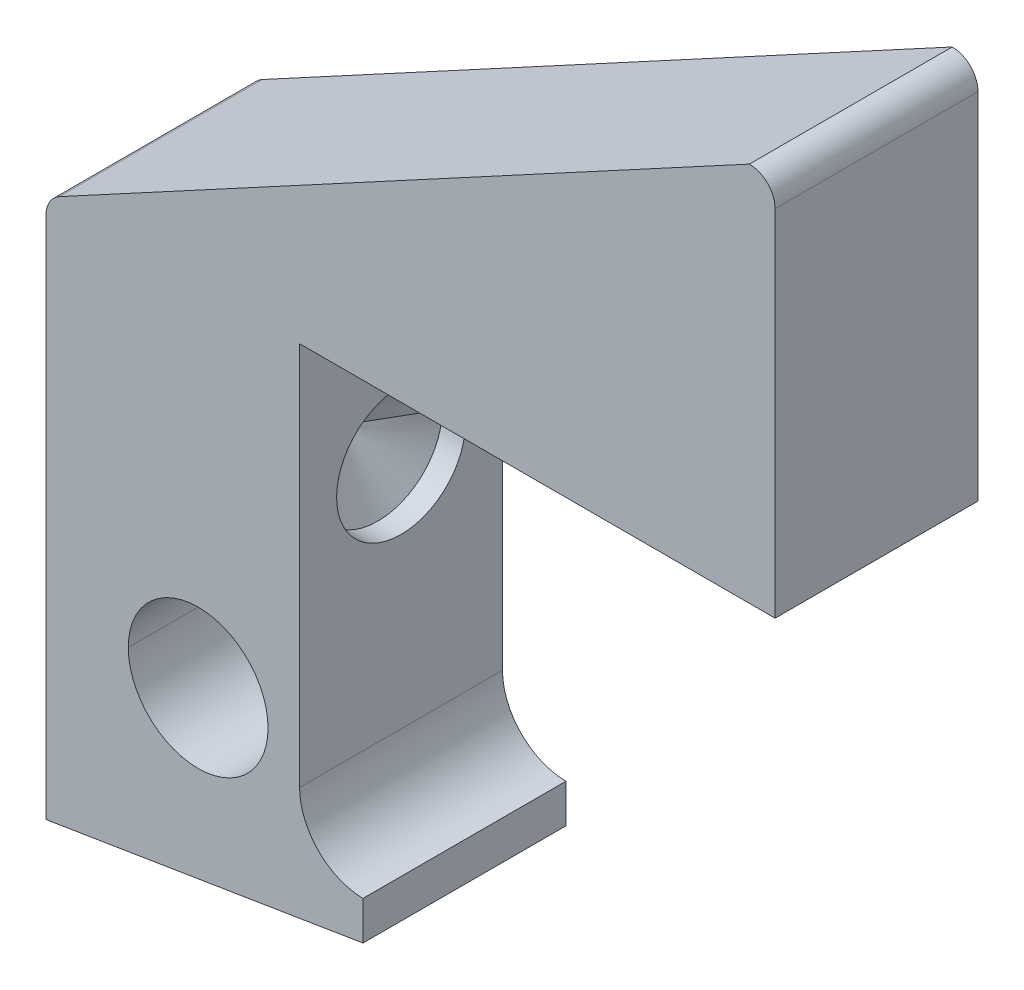
ISO-10303-21;
HEADER;
FILE_DESCRIPTION(('STEP AP214'),'2;1');
FILE_NAME('part.step','',(''),(''),'','','');
FILE_SCHEMA(('AUTOMOTIVE_DESIGN { 1 0 10303 214 1 1 1 1 }'));
ENDSEC;
DATA;
#1=APPLICATION_CONTEXT('core data for automotive mechanical design processes');
#2=APPLICATION_PROTOCOL_DEFINITION('international standard','automotive_design',2000,#1);
#3=PRODUCT_CONTEXT('',#1,'mechanical');
#4=PRODUCT('Part','Part','',(#3));
#5=PRODUCT_RELATED_PRODUCT_CATEGORY('part','',(#4));
#6=PRODUCT_DEFINITION_FORMATION('','',#4);
#7=PRODUCT_DEFINITION_CONTEXT('part definition',#1,'design');
#8=PRODUCT_DEFINITION('design','',#6,#7);
#9=PRODUCT_DEFINITION_SHAPE('','',#8);
#10=(LENGTH_UNIT() NAMED_UNIT(*) SI_UNIT(.MILLI.,.METRE.));
#11=(NAMED_UNIT(*) PLANE_ANGLE_UNIT() SI_UNIT($,.RADIAN.));
#12=(NAMED_UNIT(*) SI_UNIT($,.STERADIAN.) SOLID_ANGLE_UNIT());
#13=UNCERTAINTY_MEASURE_WITH_UNIT(LENGTH_MEASURE(1.E-05),#10,'distance_accuracy_value','');
#14=(GEOMETRIC_REPRESENTATION_CONTEXT(3) GLOBAL_UNCERTAINTY_ASSIGNED_CONTEXT((#13)) GLOBAL_UNIT_ASSIGNED_CONTEXT((#10,
#11,#12)) REPRESENTATION_CONTEXT('',''));
#15=CARTESIAN_POINT('',(0.,0.,0.));
#16=DIRECTION('',(0.,0.,1.));
#17=DIRECTION('',(1.,0.,0.));
#18=AXIS2_PLACEMENT_3D('',#15,#16,#17);
#19=CARTESIAN_POINT('',(9.99913316,12.096,4.));
#20=DIRECTION('',(-1.,0.,0.));
#21=DIRECTION('',(0.,0.,1.));
#22=AXIS2_PLACEMENT_3D('',#19,#20,#21);
#23=PLANE('',#22);
#24=CARTESIAN_POINT('',(9.99913316,21.27272472,0.));
#25=DIRECTION('',(-1.,0.,0.));
#26=DIRECTION('',(0.,0.,1.));
#27=AXIS2_PLACEMENT_3D('',#24,#25,#26);
#28=CIRCLE('',#27,2.54);
#29=CARTESIAN_POINT('',(9.99913316,21.27272472,2.54));
#30=VERTEX_POINT('',#29);
#31=CARTESIAN_POINT('',(9.99913316,21.27272472,-2.54));
#32=VERTEX_POINT('',#31);
#33=EDGE_CURVE('E11',#30,#32,#28,.T.);
#34=ORIENTED_EDGE('',*,*,#33,.T.);
#35=CARTESIAN_POINT('',(9.99913316,21.27272472,0.));
#36=DIRECTION('',(-1.,0.,0.));
#37=DIRECTION('',(0.,0.,1.));
#38=AXIS2_PLACEMENT_3D('',#35,#36,#37);
#39=CIRCLE('',#38,2.54);
#40=EDGE_CURVE('E25',#32,#30,#39,.T.);
#41=ORIENTED_EDGE('',*,*,#40,.T.);
#42=EDGE_LOOP('',(#34,#41));
#43=FACE_BOUND('',#42,.T.);
#44=DIRECTION('',(0.,1.,0.));
#45=VECTOR('',#44,1.);
#46=CARTESIAN_POINT('',(9.99913316,12.096,-4.));
#47=LINE('',#46,#45);
#48=CARTESIAN_POINT('',(9.99913316,12.096,-4.));
#49=VERTEX_POINT('',#48);
#50=CARTESIAN_POINT('',(9.99913316,27.24989158,-4.));
#51=VERTEX_POINT('',#50);
#52=EDGE_CURVE('E305',#49,#51,#47,.T.);
#53=ORIENTED_EDGE('',*,*,#52,.T.);
#54=DIRECTION('',(0.,0.,-1.));
#55=VECTOR('',#54,1.);
#56=CARTESIAN_POINT('',(9.99913316,27.24989158,4.));
#57=LINE('',#56,#55);
#58=CARTESIAN_POINT('',(9.99913316,27.24989158,4.));
#59=VERTEX_POINT('',#58);
#60=EDGE_CURVE('E300',#59,#51,#57,.T.);
#61=ORIENTED_EDGE('',*,*,#60,.F.);
#62=DIRECTION('',(0.,1.,0.));
#63=VECTOR('',#62,1.);
#64=CARTESIAN_POINT('',(9.99913316,12.096,4.));
#65=LINE('',#64,#63);
#66=CARTESIAN_POINT('',(9.99913316,12.096,4.));
#67=VERTEX_POINT('',#66);
#68=EDGE_CURVE('E295',#67,#59,#65,.T.);
#69=ORIENTED_EDGE('',*,*,#68,.F.);
#70=DIRECTION('',(0.,0.,-1.));
#71=VECTOR('',#70,1.);
#72=CARTESIAN_POINT('',(9.99913316,12.096,4.));
#73=LINE('',#72,#71);
#74=EDGE_CURVE('E291',#67,#49,#73,.T.);
#75=ORIENTED_EDGE('',*,*,#74,.T.);
#76=EDGE_LOOP('',(#53,#61,#69,#75));
#77=FACE_BOUND('',#76,.T.);
#78=ADVANCED_FACE('F17',(#43,#77),#23,.F.);
#79=CARTESIAN_POINT('',(12.5391331599986,12.0959999999986,4.));
#80=DIRECTION('',(0.,0.,1.));
#81=DIRECTION('',(0.712682713138008,0.701486529018375,0.));
#82=AXIS2_PLACEMENT_3D('',#79,#80,#81);
#83=CYLINDRICAL_SURFACE('',#82,2.54);
#84=DIRECTION('',(0.,0.,-1.));
#85=VECTOR('',#84,1.);
#86=CARTESIAN_POINT('',(12.49891658,9.5563184005287,4.));
#87=LINE('',#86,#85);
#88=CARTESIAN_POINT('',(12.49891658,9.5563184005287,4.));
#89=VERTEX_POINT('',#88);
#90=CARTESIAN_POINT('',(12.49891658,9.5563184005287,-4.));
#91=VERTEX_POINT('',#90);
#92=EDGE_CURVE('E287',#89,#91,#87,.T.);
#93=ORIENTED_EDGE('',*,*,#92,.T.);
#94=CARTESIAN_POINT('',(12.5391331599986,12.0959999999986,-4.));
#95=DIRECTION('',(0.,0.,1.));
#96=DIRECTION('',(1.,0.,0.));
#97=AXIS2_PLACEMENT_3D('',#94,#95,#96);
#98=CIRCLE('',#97,2.54);
#99=EDGE_CURVE('E282',#49,#91,#98,.T.);
#100=ORIENTED_EDGE('',*,*,#99,.F.);
#101=ORIENTED_EDGE('',*,*,#74,.F.);
#102=CARTESIAN_POINT('',(12.5391331599986,12.0959999999986,4.));
#103=DIRECTION('',(0.,0.,1.));
#104=DIRECTION('',(1.,0.,0.));
#105=AXIS2_PLACEMENT_3D('',#102,#103,#104);
#106=CIRCLE('',#105,2.54);
#107=EDGE_CURVE('E278',#67,#89,#106,.T.);
#108=ORIENTED_EDGE('',*,*,#107,.T.);
#109=EDGE_LOOP('',(#93,#100,#101,#108));
#110=FACE_BOUND('',#109,.T.);
#111=ADVANCED_FACE('F361',(#110),#83,.F.);
#112=CARTESIAN_POINT('',(12.5391331599986,12.0959999999986,4.));
#113=DIRECTION('',(0.,0.,1.));
#114=DIRECTION('',(1.,0.,0.));
#115=AXIS2_PLACEMENT_3D('',#112,#113,#114);
#116=PLANE('',#115);
#117=CARTESIAN_POINT('',(6.,13.5,4.));
#118=DIRECTION('',(0.,0.,1.));
#119=DIRECTION('',(1.,0.,0.));
#120=AXIS2_PLACEMENT_3D('',#117,#118,#119);
#121=CIRCLE('',#120,2.7559);
#122=CARTESIAN_POINT('',(8.7559,13.5,4.));
#123=VERTEX_POINT('',#122);
#124=CARTESIAN_POINT('',(3.2441,13.5,4.));
#125=VERTEX_POINT('',#124);
#126=EDGE_CURVE('E273',#123,#125,#121,.T.);
#127=ORIENTED_EDGE('',*,*,#126,.F.);
#128=CARTESIAN_POINT('',(6.,13.5,4.));
#129=DIRECTION('',(0.,0.,1.));
#130=DIRECTION('',(1.,0.,0.));
#131=AXIS2_PLACEMENT_3D('',#128,#129,#130);
#132=CIRCLE('',#131,2.7559);
#133=EDGE_CURVE('E268',#125,#123,#132,.T.);
#134=ORIENTED_EDGE('',*,*,#133,.F.);
#135=EDGE_LOOP('',(#127,#134));
#136=FACE_BOUND('',#135,.T.);
#137=DIRECTION('',(0.,-1.,0.));
#138=VECTOR('',#137,1.);
#139=CARTESIAN_POINT('',(0.,26.644315150143,4.));
#140=LINE('',#139,#138);
#141=CARTESIAN_POINT('',(0.,26.644315150143,4.));
#142=VERTEX_POINT('',#141);
#143=CARTESIAN_POINT('',(0.,6.,4.));
#144=VERTEX_POINT('',#143);
#145=EDGE_CURVE('E264',#142,#144,#140,.T.);
#146=ORIENTED_EDGE('',*,*,#145,.T.);
#147=DIRECTION('',(0.987041154037592,0.160467318280509,0.));
#148=VECTOR('',#147,1.);
#149=CARTESIAN_POINT('',(0.,6.,4.));
#150=LINE('',#149,#148);
#151=CARTESIAN_POINT('',(12.49891658,8.032,4.));
#152=VERTEX_POINT('',#151);
#153=EDGE_CURVE('E260',#144,#152,#150,.T.);
#154=ORIENTED_EDGE('',*,*,#153,.T.);
#155=DIRECTION('',(0.,1.,0.));
#156=VECTOR('',#155,1.);
#157=CARTESIAN_POINT('',(12.49891658,8.032,4.));
#158=LINE('',#157,#156);
#159=EDGE_CURVE('E255',#152,#89,#158,.T.);
#160=ORIENTED_EDGE('',*,*,#159,.T.);
#161=ORIENTED_EDGE('',*,*,#107,.F.);
#162=ORIENTED_EDGE('',*,*,#68,.T.);
#163=DIRECTION('',(1.,0.,0.));
#164=VECTOR('',#163,1.);
#165=CARTESIAN_POINT('',(9.99913316,27.24989158,4.));
#166=LINE('',#165,#164);
#167=CARTESIAN_POINT('',(28.75010842,27.24989158,4.));
#168=VERTEX_POINT('',#167);
#169=EDGE_CURVE('E251',#59,#168,#166,.T.);
#170=ORIENTED_EDGE('',*,*,#169,.T.);
#171=DIRECTION('',(0.,1.,0.));
#172=VECTOR('',#171,1.);
#173=CARTESIAN_POINT('',(28.75010842,27.24989158,4.));
#174=LINE('',#173,#172);
#175=CARTESIAN_POINT('',(28.75010842,41.23389158,4.));
#176=VERTEX_POINT('',#175);
#177=EDGE_CURVE('E247',#168,#176,#174,.T.);
#178=ORIENTED_EDGE('',*,*,#177,.T.);
#179=CARTESIAN_POINT('',(27.7341084200016,41.2338915800016,4.));
#180=DIRECTION('',(0.,0.,1.));
#181=DIRECTION('',(1.,0.,0.));
#182=AXIS2_PLACEMENT_3D('',#179,#180,#181);
#183=CIRCLE('',#182,1.016);
#184=CARTESIAN_POINT('',(27.73410842,42.24989158,4.));
#185=VERTEX_POINT('',#184);
#186=EDGE_CURVE('E243',#176,#185,#183,.T.);
#187=ORIENTED_EDGE('',*,*,#186,.T.);
#188=DIRECTION('',(-0.879592524607304,-0.475727853562254,0.));
#189=VECTOR('',#188,1.);
#190=CARTESIAN_POINT('',(27.73410842,42.24989158,4.));
#191=LINE('',#190,#189);
#192=CARTESIAN_POINT('',(0.532660500780751,27.537981155144,4.));
#193=VERTEX_POINT('',#192);
#194=EDGE_CURVE('E239',#185,#193,#191,.T.);
#195=ORIENTED_EDGE('',*,*,#194,.T.);
#196=CARTESIAN_POINT('',(1.01600000000114,26.6443151501423,4.));
#197=DIRECTION('',(0.,0.,1.));
#198=DIRECTION('',(1.,0.,0.));
#199=AXIS2_PLACEMENT_3D('',#196,#197,#198);
#200=CIRCLE('',#199,1.016);
#201=EDGE_CURVE('E235',#193,#142,#200,.T.);
#202=ORIENTED_EDGE('',*,*,#201,.T.);
#203=EDGE_LOOP('',(#146,#154,#160,#161,#162,#170,#178,#187,#195,#202));
#204=FACE_BOUND('',#203,.T.);
#205=ADVANCED_FACE('F334',(#136,#204),#116,.T.);
#206=CARTESIAN_POINT('',(1.01600000000114,26.6443151501423,4.));
#207=DIRECTION('',(0.,0.,1.));
#208=DIRECTION('',(0.858990062097008,-0.511992258943999,0.));
#209=AXIS2_PLACEMENT_3D('',#206,#207,#208);
#210=CYLINDRICAL_SURFACE('',#209,1.016);
#211=CARTESIAN_POINT('',(1.01600000000114,26.6443151501423,-4.));
#212=DIRECTION('',(0.,0.,1.));
#213=DIRECTION('',(1.,0.,0.));
#214=AXIS2_PLACEMENT_3D('',#211,#212,#213);
#215=CIRCLE('',#214,1.016);
#216=CARTESIAN_POINT('',(0.532660500780751,27.537981155144,-4.));
#217=VERTEX_POINT('',#216);
#218=CARTESIAN_POINT('',(0.,26.644315150143,-4.));
#219=VERTEX_POINT('',#218);
#220=EDGE_CURVE('E231',#217,#219,#215,.T.);
#221=ORIENTED_EDGE('',*,*,#220,.T.);
#222=DIRECTION('',(0.,0.,-1.));
#223=VECTOR('',#222,1.);
#224=CARTESIAN_POINT('',(0.,26.644315150143,4.));
#225=LINE('',#224,#223);
#226=EDGE_CURVE('E226',#142,#219,#225,.T.);
#227=ORIENTED_EDGE('',*,*,#226,.F.);
#228=ORIENTED_EDGE('',*,*,#201,.F.);
#229=DIRECTION('',(0.,0.,-1.));
#230=VECTOR('',#229,1.);
#231=CARTESIAN_POINT('',(0.532660500780751,27.537981155144,4.));
#232=LINE('',#231,#230);
#233=EDGE_CURVE('E222',#193,#217,#232,.T.);
#234=ORIENTED_EDGE('',*,*,#233,.T.);
#235=EDGE_LOOP('',(#221,#227,#228,#234));
#236=FACE_BOUND('',#235,.T.);
#237=ADVANCED_FACE('F346',(#236),#210,.T.);
#238=CARTESIAN_POINT('',(27.73410842,42.24989158,4.));
#239=DIRECTION('',(0.475727853562254,-0.879592524607304,0.));
#240=DIRECTION('',(0.879592524607304,0.475727853562254,0.));
#241=AXIS2_PLACEMENT_3D('',#238,#239,#240);
#242=PLANE('',#241);
#243=DIRECTION('',(-0.879592524607304,-0.475727853562254,0.));
#244=VECTOR('',#243,1.);
#245=CARTESIAN_POINT('',(27.73410842,42.24989158,-4.));
#246=LINE('',#245,#244);
#247=CARTESIAN_POINT('',(27.73410842,42.24989158,-4.));
#248=VERTEX_POINT('',#247);
#249=EDGE_CURVE('E217',#248,#217,#246,.T.);
#250=ORIENTED_EDGE('',*,*,#249,.T.);
#251=ORIENTED_EDGE('',*,*,#233,.F.);
#252=ORIENTED_EDGE('',*,*,#194,.F.);
#253=DIRECTION('',(0.,0.,-1.));
#254=VECTOR('',#253,1.);
#255=CARTESIAN_POINT('',(27.73410842,42.24989158,4.));
#256=LINE('',#255,#254);
#257=EDGE_CURVE('E213',#185,#248,#256,.T.);
#258=ORIENTED_EDGE('',*,*,#257,.T.);
#259=EDGE_LOOP('',(#250,#251,#252,#258));
#260=FACE_BOUND('',#259,.T.);
#261=ADVANCED_FACE('F340',(#260),#242,.F.);
#262=CARTESIAN_POINT('',(27.7341084200016,41.2338915800016,4.));
#263=DIRECTION('',(0.,0.,1.));
#264=DIRECTION('',(-0.707106781186546,-0.707106781186549,0.));
#265=AXIS2_PLACEMENT_3D('',#262,#263,#264);
#266=CYLINDRICAL_SURFACE('',#265,1.016);
#267=CARTESIAN_POINT('',(27.7341084200016,41.2338915800016,-4.));
#268=DIRECTION('',(0.,0.,1.));
#269=DIRECTION('',(1.,0.,0.));
#270=AXIS2_PLACEMENT_3D('',#267,#268,#269);
#271=CIRCLE('',#270,1.016);
#272=CARTESIAN_POINT('',(28.75010842,41.23389158,-4.));
#273=VERTEX_POINT('',#272);
#274=EDGE_CURVE('E208',#273,#248,#271,.T.);
#275=ORIENTED_EDGE('',*,*,#274,.T.);
#276=ORIENTED_EDGE('',*,*,#257,.F.);
#277=ORIENTED_EDGE('',*,*,#186,.F.);
#278=DIRECTION('',(0.,0.,-1.));
#279=VECTOR('',#278,1.);
#280=CARTESIAN_POINT('',(28.75010842,41.23389158,4.));
#281=LINE('',#280,#279);
#282=EDGE_CURVE('E204',#176,#273,#281,.T.);
#283=ORIENTED_EDGE('',*,*,#282,.T.);
#284=EDGE_LOOP('',(#275,#276,#277,#283));
#285=FACE_BOUND('',#284,.T.);
#286=ADVANCED_FACE('F338',(#285),#266,.T.);
#287=CARTESIAN_POINT('',(28.75010842,27.24989158,4.));
#288=DIRECTION('',(-1.,0.,0.));
#289=DIRECTION('',(0.,0.,1.));
#290=AXIS2_PLACEMENT_3D('',#287,#288,#289);
#291=PLANE('',#290);
#292=DIRECTION('',(0.,1.,0.));
#293=VECTOR('',#292,1.);
#294=CARTESIAN_POINT('',(28.75010842,27.24989158,-4.));
#295=LINE('',#294,#293);
#296=CARTESIAN_POINT('',(28.75010842,27.24989158,-4.));
#297=VERTEX_POINT('',#296);
#298=EDGE_CURVE('E199',#297,#273,#295,.T.);
#299=ORIENTED_EDGE('',*,*,#298,.T.);
#300=ORIENTED_EDGE('',*,*,#282,.F.);
#301=ORIENTED_EDGE('',*,*,#177,.F.);
#302=DIRECTION('',(0.,0.,-1.));
#303=VECTOR('',#302,1.);
#304=CARTESIAN_POINT('',(28.75010842,27.24989158,4.));
#305=LINE('',#304,#303);
#306=EDGE_CURVE('E195',#168,#297,#305,.T.);
#307=ORIENTED_EDGE('',*,*,#306,.T.);
#308=EDGE_LOOP('',(#299,#300,#301,#307));
#309=FACE_BOUND('',#308,.T.);
#310=ADVANCED_FACE('F330',(#309),#291,.F.);
#311=CARTESIAN_POINT('',(9.99913316,27.24989158,4.));
#312=DIRECTION('',(0.,1.,0.));
#313=DIRECTION('',(0.,0.,1.));
#314=AXIS2_PLACEMENT_3D('',#311,#312,#313);
#315=PLANE('',#314);
#316=DIRECTION('',(1.,0.,0.));
#317=VECTOR('',#316,1.);
#318=CARTESIAN_POINT('',(9.99913316,27.24989158,-4.));
#319=LINE('',#318,#317);
#320=EDGE_CURVE('E190',#51,#297,#319,.T.);
#321=ORIENTED_EDGE('',*,*,#320,.T.);
#322=ORIENTED_EDGE('',*,*,#306,.F.);
#323=ORIENTED_EDGE('',*,*,#169,.F.);
#324=ORIENTED_EDGE('',*,*,#60,.T.);
#325=EDGE_LOOP('',(#321,#322,#323,#324));
#326=FACE_BOUND('',#325,.T.);
#327=ADVANCED_FACE('F321',(#326),#315,.F.);
#328=CARTESIAN_POINT('',(12.5391331599986,12.0959999999986,-4.));
#329=DIRECTION('',(0.,0.,1.));
#330=DIRECTION('',(1.,0.,0.));
#331=AXIS2_PLACEMENT_3D('',#328,#329,#330);
#332=PLANE('',#331);
#333=CARTESIAN_POINT('',(6.,13.5,-4.));
#334=DIRECTION('',(0.,0.,1.));
#335=DIRECTION('',(1.,0.,0.));
#336=AXIS2_PLACEMENT_3D('',#333,#334,#335);
#337=CIRCLE('',#336,2.7559);
#338=CARTESIAN_POINT('',(8.7559,13.5,-4.));
#339=VERTEX_POINT('',#338);
#340=CARTESIAN_POINT('',(3.2441,13.5,-4.));
#341=VERTEX_POINT('',#340);
#342=EDGE_CURVE('E186',#339,#341,#337,.T.);
#343=ORIENTED_EDGE('',*,*,#342,.T.);
#344=CARTESIAN_POINT('',(6.,13.5,-4.));
#345=DIRECTION('',(0.,0.,1.));
#346=DIRECTION('',(1.,0.,0.));
#347=AXIS2_PLACEMENT_3D('',#344,#345,#346);
#348=CIRCLE('',#347,2.7559);
#349=EDGE_CURVE('E182',#341,#339,#348,.T.);
#350=ORIENTED_EDGE('',*,*,#349,.T.);
#351=EDGE_LOOP('',(#343,#350));
#352=FACE_BOUND('',#351,.T.);
#353=DIRECTION('',(0.,-1.,0.));
#354=VECTOR('',#353,1.);
#355=CARTESIAN_POINT('',(0.,26.644315150143,-4.));
#356=LINE('',#355,#354);
#357=CARTESIAN_POINT('',(0.,6.,-4.));
#358=VERTEX_POINT('',#357);
#359=EDGE_CURVE('E177',#219,#358,#356,.T.);
#360=ORIENTED_EDGE('',*,*,#359,.F.);
#361=ORIENTED_EDGE('',*,*,#220,.F.);
#362=ORIENTED_EDGE('',*,*,#249,.F.);
#363=ORIENTED_EDGE('',*,*,#274,.F.);
#364=ORIENTED_EDGE('',*,*,#298,.F.);
#365=ORIENTED_EDGE('',*,*,#320,.F.);
#366=ORIENTED_EDGE('',*,*,#52,.F.);
#367=ORIENTED_EDGE('',*,*,#99,.T.);
#368=DIRECTION('',(0.,1.,0.));
#369=VECTOR('',#368,1.);
#370=CARTESIAN_POINT('',(12.49891658,8.032,-4.));
#371=LINE('',#370,#369);
#372=CARTESIAN_POINT('',(12.49891658,8.032,-4.));
#373=VERTEX_POINT('',#372);
#374=EDGE_CURVE('E172',#373,#91,#371,.T.);
#375=ORIENTED_EDGE('',*,*,#374,.F.);
#376=DIRECTION('',(0.987041154037592,0.160467318280509,0.));
#377=VECTOR('',#376,1.);
#378=CARTESIAN_POINT('',(0.,6.,-4.));
#379=LINE('',#378,#377);
#380=EDGE_CURVE('E167',#358,#373,#379,.T.);
#381=ORIENTED_EDGE('',*,*,#380,.F.);
#382=EDGE_LOOP('',(#360,#361,#362,#363,#364,#365,#366,#367,#375,#381));
#383=FACE_BOUND('',#382,.T.);
#384=ADVANCED_FACE('F325',(#352,#383),#332,.F.);
#385=CARTESIAN_POINT('',(0.,6.,4.));
#386=DIRECTION('',(-0.160467318280509,0.987041154037592,0.));
#387=DIRECTION('',(-0.987041154037592,-0.160467318280509,0.));
#388=AXIS2_PLACEMENT_3D('',#385,#386,#387);
#389=PLANE('',#388);
#390=ORIENTED_EDGE('',*,*,#380,.T.);
#391=DIRECTION('',(0.,0.,-1.));
#392=VECTOR('',#391,1.);
#393=CARTESIAN_POINT('',(12.49891658,8.032,4.));
#394=LINE('',#393,#392);
#395=EDGE_CURVE('E162',#152,#373,#394,.T.);
#396=ORIENTED_EDGE('',*,*,#395,.F.);
#397=ORIENTED_EDGE('',*,*,#153,.F.);
#398=DIRECTION('',(0.,0.,-1.));
#399=VECTOR('',#398,1.);
#400=CARTESIAN_POINT('',(0.,6.,4.));
#401=LINE('',#400,#399);
#402=EDGE_CURVE('E157',#144,#358,#401,.T.);
#403=ORIENTED_EDGE('',*,*,#402,.T.);
#404=EDGE_LOOP('',(#390,#396,#397,#403));
#405=FACE_BOUND('',#404,.T.);
#406=ADVANCED_FACE('F354',(#405),#389,.F.);
#407=CARTESIAN_POINT('',(0.,26.644315150143,4.));
#408=DIRECTION('',(1.,0.,0.));
#409=DIRECTION('',(0.,0.,-1.));
#410=AXIS2_PLACEMENT_3D('',#407,#408,#409);
#411=PLANE('',#410);
#412=ORIENTED_EDGE('',*,*,#359,.T.);
#413=ORIENTED_EDGE('',*,*,#402,.F.);
#414=ORIENTED_EDGE('',*,*,#145,.F.);
#415=ORIENTED_EDGE('',*,*,#226,.T.);
#416=EDGE_LOOP('',(#412,#413,#414,#415));
#417=FACE_BOUND('',#416,.T.);
#418=ADVANCED_FACE('F350',(#417),#411,.F.);
#419=CARTESIAN_POINT('',(12.49891658,8.032,4.));
#420=DIRECTION('',(-1.,0.,0.));
#421=DIRECTION('',(0.,0.,1.));
#422=AXIS2_PLACEMENT_3D('',#419,#420,#421);
#423=PLANE('',#422);
#424=ORIENTED_EDGE('',*,*,#374,.T.);
#425=ORIENTED_EDGE('',*,*,#92,.F.);
#426=ORIENTED_EDGE('',*,*,#159,.F.);
#427=ORIENTED_EDGE('',*,*,#395,.T.);
#428=EDGE_LOOP('',(#424,#425,#426,#427));
#429=FACE_BOUND('',#428,.T.);
#430=ADVANCED_FACE('F358',(#429),#423,.F.);
#431=CARTESIAN_POINT('',(6.,13.5,4.));
#432=DIRECTION('',(0.,0.,1.));
#433=DIRECTION('',(0.,1.,0.));
#434=AXIS2_PLACEMENT_3D('',#431,#432,#433);
#435=CYLINDRICAL_SURFACE('',#434,2.7559);
#436=ORIENTED_EDGE('',*,*,#349,.F.);
#437=DIRECTION('',(0.,0.,1.));
#438=VECTOR('',#437,1.);
#439=CARTESIAN_POINT('',(3.2441,13.5,-4.));
#440=LINE('',#439,#438);
#441=EDGE_CURVE('E152',#341,#125,#440,.T.);
#442=ORIENTED_EDGE('',*,*,#441,.T.);
#443=ORIENTED_EDGE('',*,*,#133,.T.);
#444=DIRECTION('',(0.,0.,1.));
#445=VECTOR('',#444,1.);
#446=CARTESIAN_POINT('',(8.7559,13.5,-4.));
#447=LINE('',#446,#445);
#448=EDGE_CURVE('E147',#339,#123,#447,.T.);
#449=ORIENTED_EDGE('',*,*,#448,.F.);
#450=EDGE_LOOP('',(#436,#442,#443,#449));
#451=FACE_BOUND('',#450,.T.);
#452=ADVANCED_FACE('F390',(#451),#435,.F.);
#453=CARTESIAN_POINT('',(6.,13.5,4.));
#454=DIRECTION('',(0.,0.,1.));
#455=DIRECTION('',(0.,-1.,0.));
#456=AXIS2_PLACEMENT_3D('',#453,#454,#455);
#457=CYLINDRICAL_SURFACE('',#456,2.7559);
#458=ORIENTED_EDGE('',*,*,#126,.T.);
#459=ORIENTED_EDGE('',*,*,#441,.F.);
#460=ORIENTED_EDGE('',*,*,#342,.F.);
#461=ORIENTED_EDGE('',*,*,#448,.T.);
#462=EDGE_LOOP('',(#458,#459,#460,#461));
#463=FACE_BOUND('',#462,.T.);
#464=ADVANCED_FACE('F393',(#463),#457,.F.);
#465=CARTESIAN_POINT('',(24.085169683742,21.27272472,0.));
#466=DIRECTION('',(-1.,0.,0.));
#467=DIRECTION('',(0.,1.,0.));
#468=AXIS2_PLACEMENT_3D('',#465,#466,#467);
#469=CYLINDRICAL_SURFACE('',#468,2.54);
#470=CARTESIAN_POINT('',(9.0864696837416,21.27272472,0.));
#471=DIRECTION('',(1.,0.,0.));
#472=DIRECTION('',(0.,0.,-1.));
#473=AXIS2_PLACEMENT_3D('',#470,#471,#472);
#474=CIRCLE('',#473,2.54);
#475=CARTESIAN_POINT('',(9.08646968668717,21.27272472,2.53999999829932));
#476=VERTEX_POINT('',#475);
#477=CARTESIAN_POINT('',(9.0864696837416,21.27272472,-2.54));
#478=VERTEX_POINT('',#477);
#479=EDGE_CURVE('E127',#476,#478,#474,.T.);
#480=ORIENTED_EDGE('',*,*,#479,.F.);
#481=DIRECTION('',(-1.,0.,0.));
#482=VECTOR('',#481,1.);
#483=CARTESIAN_POINT('',(9.99913316,21.27272472,2.54));
#484=LINE('',#483,#482);
#485=EDGE_CURVE('E139',#30,#476,#484,.T.);
#486=ORIENTED_EDGE('',*,*,#485,.F.);
#487=ORIENTED_EDGE('',*,*,#40,.F.);
#488=DIRECTION('',(-1.,0.,0.));
#489=VECTOR('',#488,1.);
#490=CARTESIAN_POINT('',(9.99913316,21.27272472,-2.54));
#491=LINE('',#490,#489);
#492=EDGE_CURVE('E129',#32,#478,#491,.T.);
#493=ORIENTED_EDGE('',*,*,#492,.T.);
#494=EDGE_LOOP('',(#480,#486,#487,#493));
#495=FACE_BOUND('',#494,.T.);
#496=ADVANCED_FACE('F397',(#495),#469,.F.);
#497=CARTESIAN_POINT('',(24.085169683742,21.27272472,0.));
#498=DIRECTION('',(-1.,0.,0.));
#499=DIRECTION('',(0.,-1.,0.));
#500=AXIS2_PLACEMENT_3D('',#497,#498,#499);
#501=CYLINDRICAL_SURFACE('',#500,2.54);
#502=ORIENTED_EDGE('',*,*,#33,.F.);
#503=ORIENTED_EDGE('',*,*,#485,.T.);
#504=CARTESIAN_POINT('',(9.0864696837416,21.27272472,0.));
#505=DIRECTION('',(1.,0.,0.));
#506=DIRECTION('',(0.,0.,-1.));
#507=AXIS2_PLACEMENT_3D('',#504,#505,#506);
#508=CIRCLE('',#507,2.54);
#509=EDGE_CURVE('E123',#478,#476,#508,.T.);
#510=ORIENTED_EDGE('',*,*,#509,.F.);
#511=ORIENTED_EDGE('',*,*,#492,.F.);
#512=EDGE_LOOP('',(#502,#503,#510,#511));
#513=FACE_BOUND('',#512,.T.);
#514=ADVANCED_FACE('F401',(#513),#501,.F.);
#515=CARTESIAN_POINT('',(507.619999999988,21.27272472,0.));
#516=DIRECTION('',(1.,0.,0.));
#517=DIRECTION('',(0.,-1.,0.));
#518=AXIS2_PLACEMENT_3D('',#515,#516,#517);
#519=CONICAL_SURFACE('',#518,866.0254037844,1.0471975512);
#520=DIRECTION('',(0.499999999997059,0.,-0.866025403786137));
#521=VECTOR('',#520,1.);
#522=CARTESIAN_POINT('',(7.62000000393891,21.27272472,0.));
#523=LINE('',#522,#521);
#524=CARTESIAN_POINT('',(7.62,21.27272472,0.));
#525=VERTEX_POINT('',#524);
#526=EDGE_CURVE('E120',#525,#478,#523,.T.);
#527=ORIENTED_EDGE('',*,*,#526,.T.);
#528=ORIENTED_EDGE('',*,*,#509,.T.);
#529=DIRECTION('',(0.499999999997059,0.,0.866025403786137));
#530=VECTOR('',#529,1.);
#531=CARTESIAN_POINT('',(7.62000000393891,21.27272472,0.));
#532=LINE('',#531,#530);
#533=EDGE_CURVE('E117',#525,#476,#532,.T.);
#534=ORIENTED_EDGE('',*,*,#533,.F.);
#535=EDGE_LOOP('',(#527,#528,#534));
#536=FACE_BOUND('',#535,.T.);
#537=ADVANCED_FACE('F119',(#536),#519,.F.);
#538=CARTESIAN_POINT('',(507.619999999988,21.27272472,0.));
#539=DIRECTION('',(1.,0.,0.));
#540=DIRECTION('',(0.,1.,0.));
#541=AXIS2_PLACEMENT_3D('',#538,#539,#540);
#542=CONICAL_SURFACE('',#541,866.0254037844,1.0471975512);
#543=ORIENTED_EDGE('',*,*,#533,.T.);
#544=ORIENTED_EDGE('',*,*,#479,.T.);
#545=ORIENTED_EDGE('',*,*,#526,.F.);
#546=EDGE_LOOP('',(#543,#544,#545));
#547=FACE_BOUND('',#546,.T.);
#548=ADVANCED_FACE('F126',(#547),#542,.F.);
#549=CLOSED_SHELL('',(#78,#111,#205,#237,#261,#286,#310,#327,#384,#406,#418,#430,#452,#464,#496,
#514,#537,#548));
#550=MANIFOLD_SOLID_BREP('B1',#549);
#551=ADVANCED_BREP_SHAPE_REPRESENTATION('',(#18,#550),#14);
#552=SHAPE_DEFINITION_REPRESENTATION(#9,#551);
ENDSEC;
END-ISO-10303-21;
